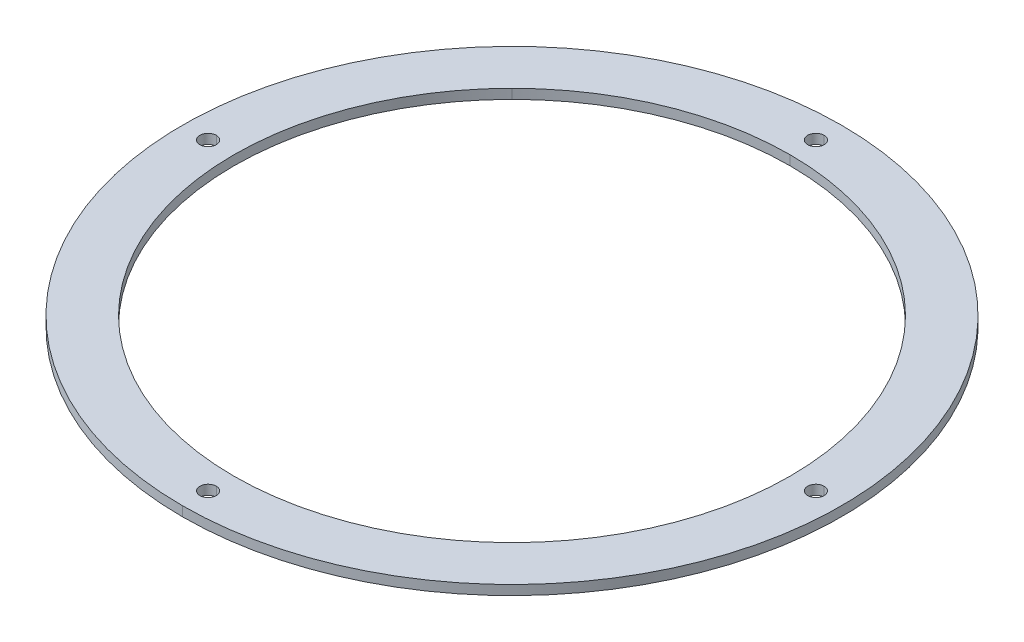
ISO-10303-21;
HEADER;
FILE_DESCRIPTION(('STEP AP214'),'2;1');
FILE_NAME('part.step','',(''),(''),'','','');
FILE_SCHEMA(('AUTOMOTIVE_DESIGN { 1 0 10303 214 1 1 1 1 }'));
ENDSEC;
DATA;
#1=APPLICATION_CONTEXT('core data for automotive mechanical design processes');
#2=APPLICATION_PROTOCOL_DEFINITION('international standard','automotive_design',2000,#1);
#3=PRODUCT_CONTEXT('',#1,'mechanical');
#4=PRODUCT('Part','Part','',(#3));
#5=PRODUCT_RELATED_PRODUCT_CATEGORY('part','',(#4));
#6=PRODUCT_DEFINITION_FORMATION('','',#4);
#7=PRODUCT_DEFINITION_CONTEXT('part definition',#1,'design');
#8=PRODUCT_DEFINITION('design','',#6,#7);
#9=PRODUCT_DEFINITION_SHAPE('','',#8);
#10=(LENGTH_UNIT() NAMED_UNIT(*) SI_UNIT(.MILLI.,.METRE.));
#11=(NAMED_UNIT(*) PLANE_ANGLE_UNIT() SI_UNIT($,.RADIAN.));
#12=(NAMED_UNIT(*) SI_UNIT($,.STERADIAN.) SOLID_ANGLE_UNIT());
#13=UNCERTAINTY_MEASURE_WITH_UNIT(LENGTH_MEASURE(1.E-05),#10,'distance_accuracy_value','');
#14=(GEOMETRIC_REPRESENTATION_CONTEXT(3) GLOBAL_UNCERTAINTY_ASSIGNED_CONTEXT((#13)) GLOBAL_UNIT_ASSIGNED_CONTEXT((#10,
#11,#12)) REPRESENTATION_CONTEXT('',''));
#15=CARTESIAN_POINT('',(0.,0.,0.));
#16=DIRECTION('',(0.,0.,1.));
#17=DIRECTION('',(1.,0.,0.));
#18=AXIS2_PLACEMENT_3D('',#15,#16,#17);
#19=CARTESIAN_POINT('',(0.,0.,0.));
#20=DIRECTION('',(0.,1.,0.));
#21=DIRECTION('',(1.,0.,0.));
#22=AXIS2_PLACEMENT_3D('',#19,#20,#21);
#23=PLANE('',#22);
#24=CARTESIAN_POINT('',(0.,0.,-94.75));
#25=DIRECTION('',(0.,1.,0.));
#26=DIRECTION('',(0.,0.,1.));
#27=AXIS2_PLACEMENT_3D('',#24,#25,#26);
#28=CIRCLE('',#27,2.5527);
#29=CARTESIAN_POINT('',(0.,0.,-97.3027));
#30=VERTEX_POINT('',#29);
#31=CARTESIAN_POINT('',(0.,0.,-92.1973));
#32=VERTEX_POINT('',#31);
#33=EDGE_CURVE('E165',#30,#32,#28,.T.);
#34=ORIENTED_EDGE('',*,*,#33,.T.);
#35=CARTESIAN_POINT('',(0.,0.,-94.75));
#36=DIRECTION('',(0.,1.,0.));
#37=DIRECTION('',(0.,0.,1.));
#38=AXIS2_PLACEMENT_3D('',#35,#36,#37);
#39=CIRCLE('',#38,2.5527);
#40=EDGE_CURVE('E11',#32,#30,#39,.T.);
#41=ORIENTED_EDGE('',*,*,#40,.T.);
#42=EDGE_LOOP('',(#34,#41));
#43=FACE_BOUND('',#42,.T.);
#44=CARTESIAN_POINT('',(-0.001,0.,-0.001));
#45=DIRECTION('',(0.,1.,0.));
#46=DIRECTION('',(0.,0.,1.));
#47=AXIS2_PLACEMENT_3D('',#44,#45,#46);
#48=CIRCLE('',#47,86.75);
#49=CARTESIAN_POINT('',(-61.3420132658952,0.,-61.3430132658953));
#50=VERTEX_POINT('',#49);
#51=CARTESIAN_POINT('',(-61.3420132658953,0.,61.3410132658952));
#52=VERTEX_POINT('',#51);
#53=EDGE_CURVE('E279',#50,#52,#48,.T.);
#54=ORIENTED_EDGE('',*,*,#53,.T.);
#55=CARTESIAN_POINT('',(0.,0.,0.));
#56=DIRECTION('',(0.,1.,0.));
#57=DIRECTION('',(0.,0.,1.));
#58=AXIS2_PLACEMENT_3D('',#55,#56,#57);
#59=CIRCLE('',#58,86.75);
#60=CARTESIAN_POINT('',(61.3420132658951,0.,61.3410132658953));
#61=VERTEX_POINT('',#60);
#62=EDGE_CURVE('E51',#52,#61,#59,.T.);
#63=ORIENTED_EDGE('',*,*,#62,.T.);
#64=CARTESIAN_POINT('',(0.001,0.,-0.001));
#65=DIRECTION('',(0.,1.,0.));
#66=DIRECTION('',(0.,0.,1.));
#67=AXIS2_PLACEMENT_3D('',#64,#65,#66);
#68=CIRCLE('',#67,86.75);
#69=CARTESIAN_POINT('',(61.3420132658953,0.,-61.3430132658951));
#70=VERTEX_POINT('',#69);
#71=EDGE_CURVE('E298',#61,#70,#68,.T.);
#72=ORIENTED_EDGE('',*,*,#71,.T.);
#73=CARTESIAN_POINT('',(0.,0.,-0.002));
#74=DIRECTION('',(0.,1.,0.));
#75=DIRECTION('',(0.,0.,1.));
#76=AXIS2_PLACEMENT_3D('',#73,#74,#75);
#77=CIRCLE('',#76,86.75);
#78=CARTESIAN_POINT('',(0.,0.,-86.752));
#79=VERTEX_POINT('',#78);
#80=EDGE_CURVE('E215',#70,#79,#77,.T.);
#81=ORIENTED_EDGE('',*,*,#80,.T.);
#82=CARTESIAN_POINT('',(0.,0.,-0.002));
#83=DIRECTION('',(0.,1.,0.));
#84=DIRECTION('',(0.,0.,1.));
#85=AXIS2_PLACEMENT_3D('',#82,#83,#84);
#86=CIRCLE('',#85,86.75);
#87=EDGE_CURVE('E295',#79,#50,#86,.T.);
#88=ORIENTED_EDGE('',*,*,#87,.T.);
#89=EDGE_LOOP('',(#54,#63,#72,#81,#88));
#90=FACE_BOUND('',#89,.T.);
#91=CARTESIAN_POINT('',(94.75,0.,0.));
#92=DIRECTION('',(0.,1.,0.));
#93=DIRECTION('',(0.,0.,1.));
#94=AXIS2_PLACEMENT_3D('',#91,#92,#93);
#95=CIRCLE('',#94,2.5527);
#96=CARTESIAN_POINT('',(94.75,0.,-2.5527));
#97=VERTEX_POINT('',#96);
#98=CARTESIAN_POINT('',(94.75,0.,2.5527));
#99=VERTEX_POINT('',#98);
#100=EDGE_CURVE('E251',#97,#99,#95,.T.);
#101=ORIENTED_EDGE('',*,*,#100,.T.);
#102=CARTESIAN_POINT('',(94.75,0.,0.));
#103=DIRECTION('',(0.,1.,0.));
#104=DIRECTION('',(0.,0.,1.));
#105=AXIS2_PLACEMENT_3D('',#102,#103,#104);
#106=CIRCLE('',#105,2.5527);
#107=EDGE_CURVE('E311',#99,#97,#106,.T.);
#108=ORIENTED_EDGE('',*,*,#107,.T.);
#109=EDGE_LOOP('',(#101,#108));
#110=FACE_BOUND('',#109,.T.);
#111=CARTESIAN_POINT('',(0.,0.,94.75));
#112=DIRECTION('',(0.,1.,0.));
#113=DIRECTION('',(0.,0.,1.));
#114=AXIS2_PLACEMENT_3D('',#111,#112,#113);
#115=CIRCLE('',#114,2.5527);
#116=CARTESIAN_POINT('',(0.,0.,92.1973));
#117=VERTEX_POINT('',#116);
#118=CARTESIAN_POINT('',(0.,0.,97.3027));
#119=VERTEX_POINT('',#118);
#120=EDGE_CURVE('E235',#117,#119,#115,.T.);
#121=ORIENTED_EDGE('',*,*,#120,.T.);
#122=CARTESIAN_POINT('',(0.,0.,94.75));
#123=DIRECTION('',(0.,1.,0.));
#124=DIRECTION('',(0.,0.,1.));
#125=AXIS2_PLACEMENT_3D('',#122,#123,#124);
#126=CIRCLE('',#125,2.5527);
#127=EDGE_CURVE('E289',#119,#117,#126,.T.);
#128=ORIENTED_EDGE('',*,*,#127,.T.);
#129=EDGE_LOOP('',(#121,#128));
#130=FACE_BOUND('',#129,.T.);
#131=CARTESIAN_POINT('',(-94.75,0.,0.));
#132=DIRECTION('',(0.,1.,0.));
#133=DIRECTION('',(0.,0.,1.));
#134=AXIS2_PLACEMENT_3D('',#131,#132,#133);
#135=CIRCLE('',#134,2.5527);
#136=CARTESIAN_POINT('',(-94.75,0.,-2.55270000000004));
#137=VERTEX_POINT('',#136);
#138=CARTESIAN_POINT('',(-94.75,0.,2.5527));
#139=VERTEX_POINT('',#138);
#140=EDGE_CURVE('E225',#137,#139,#135,.T.);
#141=ORIENTED_EDGE('',*,*,#140,.T.);
#142=CARTESIAN_POINT('',(-94.75,0.,0.));
#143=DIRECTION('',(0.,1.,0.));
#144=DIRECTION('',(0.,0.,1.));
#145=AXIS2_PLACEMENT_3D('',#142,#143,#144);
#146=CIRCLE('',#145,2.5527);
#147=EDGE_CURVE('E265',#139,#137,#146,.T.);
#148=ORIENTED_EDGE('',*,*,#147,.T.);
#149=EDGE_LOOP('',(#141,#148));
#150=FACE_BOUND('',#149,.T.);
#151=CARTESIAN_POINT('',(0.,0.,0.));
#152=DIRECTION('',(0.,1.,0.));
#153=DIRECTION('',(0.,0.,1.));
#154=AXIS2_PLACEMENT_3D('',#151,#152,#153);
#155=CIRCLE('',#154,102.75);
#156=CARTESIAN_POINT('',(0.,0.,-102.75));
#157=VERTEX_POINT('',#156);
#158=CARTESIAN_POINT('',(0.,0.,102.75));
#159=VERTEX_POINT('',#158);
#160=EDGE_CURVE('E20',#157,#159,#155,.T.);
#161=ORIENTED_EDGE('',*,*,#160,.F.);
#162=CARTESIAN_POINT('',(0.,0.,0.));
#163=DIRECTION('',(0.,1.,0.));
#164=DIRECTION('',(0.,0.,1.));
#165=AXIS2_PLACEMENT_3D('',#162,#163,#164);
#166=CIRCLE('',#165,102.75);
#167=EDGE_CURVE('E190',#159,#157,#166,.T.);
#168=ORIENTED_EDGE('',*,*,#167,.F.);
#169=EDGE_LOOP('',(#161,#168));
#170=FACE_BOUND('',#169,.T.);
#171=ADVANCED_FACE('F17',(#43,#90,#110,#130,#150,#170),#23,.F.);
#172=CARTESIAN_POINT('',(0.,2.9972,0.));
#173=DIRECTION('',(0.,1.,0.));
#174=DIRECTION('',(1.,0.,0.));
#175=AXIS2_PLACEMENT_3D('',#172,#173,#174);
#176=PLANE('',#175);
#177=CARTESIAN_POINT('',(0.,2.9972,-94.75));
#178=DIRECTION('',(0.,1.,0.));
#179=DIRECTION('',(0.,0.,1.));
#180=AXIS2_PLACEMENT_3D('',#177,#178,#179);
#181=CIRCLE('',#180,2.5527);
#182=CARTESIAN_POINT('',(0.,2.9972,-97.3027));
#183=VERTEX_POINT('',#182);
#184=CARTESIAN_POINT('',(0.,2.9972,-92.1973));
#185=VERTEX_POINT('',#184);
#186=EDGE_CURVE('E186',#183,#185,#181,.T.);
#187=ORIENTED_EDGE('',*,*,#186,.F.);
#188=CARTESIAN_POINT('',(0.,2.9972,-94.75));
#189=DIRECTION('',(0.,1.,0.));
#190=DIRECTION('',(0.,0.,1.));
#191=AXIS2_PLACEMENT_3D('',#188,#189,#190);
#192=CIRCLE('',#191,2.5527);
#193=EDGE_CURVE('E26',#185,#183,#192,.T.);
#194=ORIENTED_EDGE('',*,*,#193,.F.);
#195=EDGE_LOOP('',(#187,#194));
#196=FACE_BOUND('',#195,.T.);
#197=CARTESIAN_POINT('',(-0.001,2.9972,-0.001));
#198=DIRECTION('',(0.,1.,0.));
#199=DIRECTION('',(0.,0.,1.));
#200=AXIS2_PLACEMENT_3D('',#197,#198,#199);
#201=CIRCLE('',#200,86.75);
#202=CARTESIAN_POINT('',(-61.3420132658952,2.9972,-61.3430132658953));
#203=VERTEX_POINT('',#202);
#204=CARTESIAN_POINT('',(-61.3420132658953,2.9972,61.3410132658952));
#205=VERTEX_POINT('',#204);
#206=EDGE_CURVE('E257',#203,#205,#201,.T.);
#207=ORIENTED_EDGE('',*,*,#206,.F.);
#208=CARTESIAN_POINT('',(0.,2.9972,-0.002));
#209=DIRECTION('',(0.,1.,0.));
#210=DIRECTION('',(0.,0.,1.));
#211=AXIS2_PLACEMENT_3D('',#208,#209,#210);
#212=CIRCLE('',#211,86.75);
#213=CARTESIAN_POINT('',(0.,2.9972,-86.752));
#214=VERTEX_POINT('',#213);
#215=EDGE_CURVE('E256',#214,#203,#212,.T.);
#216=ORIENTED_EDGE('',*,*,#215,.F.);
#217=CARTESIAN_POINT('',(0.,2.9972,-0.002));
#218=DIRECTION('',(0.,1.,0.));
#219=DIRECTION('',(0.,0.,1.));
#220=AXIS2_PLACEMENT_3D('',#217,#218,#219);
#221=CIRCLE('',#220,86.75);
#222=CARTESIAN_POINT('',(61.3420132658953,2.9972,-61.3430132658951));
#223=VERTEX_POINT('',#222);
#224=EDGE_CURVE('E216',#223,#214,#221,.T.);
#225=ORIENTED_EDGE('',*,*,#224,.F.);
#226=CARTESIAN_POINT('',(0.001,2.9972,-0.001));
#227=DIRECTION('',(0.,1.,0.));
#228=DIRECTION('',(0.,0.,1.));
#229=AXIS2_PLACEMENT_3D('',#226,#227,#228);
#230=CIRCLE('',#229,86.75);
#231=CARTESIAN_POINT('',(61.3420132658951,2.9972,61.3410132658953));
#232=VERTEX_POINT('',#231);
#233=EDGE_CURVE('E201',#232,#223,#230,.T.);
#234=ORIENTED_EDGE('',*,*,#233,.F.);
#235=CARTESIAN_POINT('',(0.,2.9972,0.));
#236=DIRECTION('',(0.,1.,0.));
#237=DIRECTION('',(0.,0.,1.));
#238=AXIS2_PLACEMENT_3D('',#235,#236,#237);
#239=CIRCLE('',#238,86.75);
#240=EDGE_CURVE('E40',#205,#232,#239,.T.);
#241=ORIENTED_EDGE('',*,*,#240,.F.);
#242=EDGE_LOOP('',(#207,#216,#225,#234,#241));
#243=FACE_BOUND('',#242,.T.);
#244=CARTESIAN_POINT('',(94.75,2.9972,0.));
#245=DIRECTION('',(0.,1.,0.));
#246=DIRECTION('',(0.,0.,1.));
#247=AXIS2_PLACEMENT_3D('',#244,#245,#246);
#248=CIRCLE('',#247,2.5527);
#249=CARTESIAN_POINT('',(94.75,2.9972,-2.5527));
#250=VERTEX_POINT('',#249);
#251=CARTESIAN_POINT('',(94.75,2.9972,2.5527));
#252=VERTEX_POINT('',#251);
#253=EDGE_CURVE('E243',#250,#252,#248,.T.);
#254=ORIENTED_EDGE('',*,*,#253,.F.);
#255=CARTESIAN_POINT('',(94.75,2.9972,0.));
#256=DIRECTION('',(0.,1.,0.));
#257=DIRECTION('',(0.,0.,1.));
#258=AXIS2_PLACEMENT_3D('',#255,#256,#257);
#259=CIRCLE('',#258,2.5527);
#260=EDGE_CURVE('E308',#252,#250,#259,.T.);
#261=ORIENTED_EDGE('',*,*,#260,.F.);
#262=EDGE_LOOP('',(#254,#261));
#263=FACE_BOUND('',#262,.T.);
#264=CARTESIAN_POINT('',(0.,2.9972,94.75));
#265=DIRECTION('',(0.,1.,0.));
#266=DIRECTION('',(0.,0.,1.));
#267=AXIS2_PLACEMENT_3D('',#264,#265,#266);
#268=CIRCLE('',#267,2.5527);
#269=CARTESIAN_POINT('',(0.,2.9972,92.1973));
#270=VERTEX_POINT('',#269);
#271=CARTESIAN_POINT('',(0.,2.9972,97.3027));
#272=VERTEX_POINT('',#271);
#273=EDGE_CURVE('E205',#270,#272,#268,.T.);
#274=ORIENTED_EDGE('',*,*,#273,.F.);
#275=CARTESIAN_POINT('',(0.,2.9972,94.75));
#276=DIRECTION('',(0.,1.,0.));
#277=DIRECTION('',(0.,0.,1.));
#278=AXIS2_PLACEMENT_3D('',#275,#276,#277);
#279=CIRCLE('',#278,2.5527);
#280=EDGE_CURVE('E314',#272,#270,#279,.T.);
#281=ORIENTED_EDGE('',*,*,#280,.F.);
#282=EDGE_LOOP('',(#274,#281));
#283=FACE_BOUND('',#282,.T.);
#284=CARTESIAN_POINT('',(-94.75,2.9972,0.));
#285=DIRECTION('',(0.,1.,0.));
#286=DIRECTION('',(0.,0.,1.));
#287=AXIS2_PLACEMENT_3D('',#284,#285,#286);
#288=CIRCLE('',#287,2.5527);
#289=CARTESIAN_POINT('',(-94.75,2.9972,-2.55270000000004));
#290=VERTEX_POINT('',#289);
#291=CARTESIAN_POINT('',(-94.75,2.9972,2.5527));
#292=VERTEX_POINT('',#291);
#293=EDGE_CURVE('E220',#290,#292,#288,.T.);
#294=ORIENTED_EDGE('',*,*,#293,.F.);
#295=CARTESIAN_POINT('',(-94.75,2.9972,0.));
#296=DIRECTION('',(0.,1.,0.));
#297=DIRECTION('',(0.,0.,1.));
#298=AXIS2_PLACEMENT_3D('',#295,#296,#297);
#299=CIRCLE('',#298,2.5527);
#300=EDGE_CURVE('E286',#292,#290,#299,.T.);
#301=ORIENTED_EDGE('',*,*,#300,.F.);
#302=EDGE_LOOP('',(#294,#301));
#303=FACE_BOUND('',#302,.T.);
#304=CARTESIAN_POINT('',(0.,2.9972,0.));
#305=DIRECTION('',(0.,1.,0.));
#306=DIRECTION('',(0.,0.,1.));
#307=AXIS2_PLACEMENT_3D('',#304,#305,#306);
#308=CIRCLE('',#307,102.75);
#309=CARTESIAN_POINT('',(0.,2.9972,-102.75));
#310=VERTEX_POINT('',#309);
#311=CARTESIAN_POINT('',(0.,2.9972,102.75));
#312=VERTEX_POINT('',#311);
#313=EDGE_CURVE('E262',#310,#312,#308,.T.);
#314=ORIENTED_EDGE('',*,*,#313,.T.);
#315=CARTESIAN_POINT('',(0.,2.9972,0.));
#316=DIRECTION('',(0.,1.,0.));
#317=DIRECTION('',(0.,0.,1.));
#318=AXIS2_PLACEMENT_3D('',#315,#316,#317);
#319=CIRCLE('',#318,102.75);
#320=EDGE_CURVE('E176',#312,#310,#319,.T.);
#321=ORIENTED_EDGE('',*,*,#320,.T.);
#322=EDGE_LOOP('',(#314,#321));
#323=FACE_BOUND('',#322,.T.);
#324=ADVANCED_FACE('F336',(#196,#243,#263,#283,#303,#323),#176,.T.);
#325=CARTESIAN_POINT('',(0.,2.9972,-94.75));
#326=DIRECTION('',(0.,-1.,0.));
#327=DIRECTION('',(0.,0.,-1.));
#328=AXIS2_PLACEMENT_3D('',#325,#326,#327);
#329=CYLINDRICAL_SURFACE('',#328,2.5527);
#330=DIRECTION('',(0.,-1.,0.));
#331=VECTOR('',#330,1.);
#332=CARTESIAN_POINT('',(0.,2.9972,-92.1973));
#333=LINE('',#332,#331);
#334=EDGE_CURVE('E179',#185,#32,#333,.T.);
#335=ORIENTED_EDGE('',*,*,#334,.F.);
#336=ORIENTED_EDGE('',*,*,#193,.T.);
#337=DIRECTION('',(0.,-1.,0.));
#338=VECTOR('',#337,1.);
#339=CARTESIAN_POINT('',(0.,2.9972,-97.3027));
#340=LINE('',#339,#338);
#341=EDGE_CURVE('E170',#183,#30,#340,.T.);
#342=ORIENTED_EDGE('',*,*,#341,.T.);
#343=ORIENTED_EDGE('',*,*,#40,.F.);
#344=EDGE_LOOP('',(#335,#336,#342,#343));
#345=FACE_BOUND('',#344,.T.);
#346=ADVANCED_FACE('F171',(#345),#329,.F.);
#347=CARTESIAN_POINT('',(0.,2.9972,0.));
#348=DIRECTION('',(0.,-1.,0.));
#349=DIRECTION('',(0.,0.,-1.));
#350=AXIS2_PLACEMENT_3D('',#347,#348,#349);
#351=CYLINDRICAL_SURFACE('',#350,102.75);
#352=DIRECTION('',(0.,-1.,0.));
#353=VECTOR('',#352,1.);
#354=CARTESIAN_POINT('',(0.,2.9972,102.75));
#355=LINE('',#354,#353);
#356=EDGE_CURVE('E194',#312,#159,#355,.T.);
#357=ORIENTED_EDGE('',*,*,#356,.F.);
#358=ORIENTED_EDGE('',*,*,#313,.F.);
#359=DIRECTION('',(0.,-1.,0.));
#360=VECTOR('',#359,1.);
#361=CARTESIAN_POINT('',(0.,2.9972,-102.75));
#362=LINE('',#361,#360);
#363=EDGE_CURVE('E193',#310,#157,#362,.T.);
#364=ORIENTED_EDGE('',*,*,#363,.T.);
#365=ORIENTED_EDGE('',*,*,#160,.T.);
#366=EDGE_LOOP('',(#357,#358,#364,#365));
#367=FACE_BOUND('',#366,.T.);
#368=ADVANCED_FACE('F329',(#367),#351,.T.);
#369=CARTESIAN_POINT('',(-94.75,2.9972,0.));
#370=DIRECTION('',(0.,-1.,0.));
#371=DIRECTION('',(0.,0.,-1.));
#372=AXIS2_PLACEMENT_3D('',#369,#370,#371);
#373=CYLINDRICAL_SURFACE('',#372,2.5527);
#374=DIRECTION('',(0.,-1.,0.));
#375=VECTOR('',#374,1.);
#376=CARTESIAN_POINT('',(-94.75,2.9972,2.5527));
#377=LINE('',#376,#375);
#378=EDGE_CURVE('E224',#292,#139,#377,.T.);
#379=ORIENTED_EDGE('',*,*,#378,.F.);
#380=ORIENTED_EDGE('',*,*,#300,.T.);
#381=DIRECTION('',(0.,-1.,0.));
#382=VECTOR('',#381,1.);
#383=CARTESIAN_POINT('',(-94.75,2.9972,-2.55270000000004));
#384=LINE('',#383,#382);
#385=EDGE_CURVE('E210',#290,#137,#384,.T.);
#386=ORIENTED_EDGE('',*,*,#385,.T.);
#387=ORIENTED_EDGE('',*,*,#147,.F.);
#388=EDGE_LOOP('',(#379,#380,#386,#387));
#389=FACE_BOUND('',#388,.T.);
#390=ADVANCED_FACE('F353',(#389),#373,.F.);
#391=CARTESIAN_POINT('',(0.,2.9972,94.75));
#392=DIRECTION('',(0.,-1.,0.));
#393=DIRECTION('',(0.,0.,-1.));
#394=AXIS2_PLACEMENT_3D('',#391,#392,#393);
#395=CYLINDRICAL_SURFACE('',#394,2.5527);
#396=DIRECTION('',(0.,-1.,0.));
#397=VECTOR('',#396,1.);
#398=CARTESIAN_POINT('',(0.,2.9972,97.3027));
#399=LINE('',#398,#397);
#400=EDGE_CURVE('E209',#272,#119,#399,.T.);
#401=ORIENTED_EDGE('',*,*,#400,.F.);
#402=ORIENTED_EDGE('',*,*,#280,.T.);
#403=DIRECTION('',(0.,-1.,0.));
#404=VECTOR('',#403,1.);
#405=CARTESIAN_POINT('',(0.,2.9972,92.1973));
#406=LINE('',#405,#404);
#407=EDGE_CURVE('E239',#270,#117,#406,.T.);
#408=ORIENTED_EDGE('',*,*,#407,.T.);
#409=ORIENTED_EDGE('',*,*,#127,.F.);
#410=EDGE_LOOP('',(#401,#402,#408,#409));
#411=FACE_BOUND('',#410,.T.);
#412=ADVANCED_FACE('F356',(#411),#395,.F.);
#413=CARTESIAN_POINT('',(94.75,2.9972,0.));
#414=DIRECTION('',(0.,-1.,0.));
#415=DIRECTION('',(0.,0.,-1.));
#416=AXIS2_PLACEMENT_3D('',#413,#414,#415);
#417=CYLINDRICAL_SURFACE('',#416,2.5527);
#418=DIRECTION('',(0.,-1.,0.));
#419=VECTOR('',#418,1.);
#420=CARTESIAN_POINT('',(94.75,2.9972,2.5527));
#421=LINE('',#420,#419);
#422=EDGE_CURVE('E247',#252,#99,#421,.T.);
#423=ORIENTED_EDGE('',*,*,#422,.F.);
#424=ORIENTED_EDGE('',*,*,#260,.T.);
#425=DIRECTION('',(0.,-1.,0.));
#426=VECTOR('',#425,1.);
#427=CARTESIAN_POINT('',(94.75,2.9972,-2.5527));
#428=LINE('',#427,#426);
#429=EDGE_CURVE('E261',#250,#97,#428,.T.);
#430=ORIENTED_EDGE('',*,*,#429,.T.);
#431=ORIENTED_EDGE('',*,*,#107,.F.);
#432=EDGE_LOOP('',(#423,#424,#430,#431));
#433=FACE_BOUND('',#432,.T.);
#434=ADVANCED_FACE('F390',(#433),#417,.F.);
#435=CARTESIAN_POINT('',(0.,2.9972,0.));
#436=DIRECTION('',(0.,-1.,0.));
#437=DIRECTION('',(0.,0.,-1.));
#438=AXIS2_PLACEMENT_3D('',#435,#436,#437);
#439=CYLINDRICAL_SURFACE('',#438,86.75);
#440=ORIENTED_EDGE('',*,*,#62,.F.);
#441=DIRECTION('',(0.,-1.,0.));
#442=VECTOR('',#441,1.);
#443=CARTESIAN_POINT('',(-61.3420132658953,2.9972,61.3410132658952));
#444=LINE('',#443,#442);
#445=EDGE_CURVE('E252',#205,#52,#444,.T.);
#446=ORIENTED_EDGE('',*,*,#445,.F.);
#447=ORIENTED_EDGE('',*,*,#240,.T.);
#448=DIRECTION('',(0.,-1.,0.));
#449=VECTOR('',#448,1.);
#450=CARTESIAN_POINT('',(61.3420132658951,2.9972,61.3410132658953));
#451=LINE('',#450,#449);
#452=EDGE_CURVE('E301',#232,#61,#451,.T.);
#453=ORIENTED_EDGE('',*,*,#452,.T.);
#454=EDGE_LOOP('',(#440,#446,#447,#453));
#455=FACE_BOUND('',#454,.T.);
#456=ADVANCED_FACE('F377',(#455),#439,.F.);
#457=CARTESIAN_POINT('',(0.001,2.9972,-0.001));
#458=DIRECTION('',(0.,-1.,0.));
#459=DIRECTION('',(0.,0.,-1.));
#460=AXIS2_PLACEMENT_3D('',#457,#458,#459);
#461=CYLINDRICAL_SURFACE('',#460,86.75);
#462=ORIENTED_EDGE('',*,*,#71,.F.);
#463=ORIENTED_EDGE('',*,*,#452,.F.);
#464=ORIENTED_EDGE('',*,*,#233,.T.);
#465=DIRECTION('',(0.,-1.,0.));
#466=VECTOR('',#465,1.);
#467=CARTESIAN_POINT('',(61.3420132658953,2.9972,-61.3430132658951));
#468=LINE('',#467,#466);
#469=EDGE_CURVE('E275',#223,#70,#468,.T.);
#470=ORIENTED_EDGE('',*,*,#469,.T.);
#471=EDGE_LOOP('',(#462,#463,#464,#470));
#472=FACE_BOUND('',#471,.T.);
#473=ADVANCED_FACE('F374',(#472),#461,.F.);
#474=CARTESIAN_POINT('',(0.,2.9972,-0.002));
#475=DIRECTION('',(0.,-1.,0.));
#476=DIRECTION('',(0.,0.,-1.));
#477=AXIS2_PLACEMENT_3D('',#474,#475,#476);
#478=CYLINDRICAL_SURFACE('',#477,86.75);
#479=DIRECTION('',(0.,-1.,0.));
#480=VECTOR('',#479,1.);
#481=CARTESIAN_POINT('',(0.,2.9972,-86.752));
#482=LINE('',#481,#480);
#483=EDGE_CURVE('E211',#214,#79,#482,.T.);
#484=ORIENTED_EDGE('',*,*,#483,.F.);
#485=ORIENTED_EDGE('',*,*,#215,.T.);
#486=DIRECTION('',(0.,-1.,0.));
#487=VECTOR('',#486,1.);
#488=CARTESIAN_POINT('',(-61.3420132658952,2.9972,-61.3430132658953));
#489=LINE('',#488,#487);
#490=EDGE_CURVE('E282',#203,#50,#489,.T.);
#491=ORIENTED_EDGE('',*,*,#490,.T.);
#492=ORIENTED_EDGE('',*,*,#87,.F.);
#493=EDGE_LOOP('',(#484,#485,#491,#492));
#494=FACE_BOUND('',#493,.T.);
#495=ADVANCED_FACE('F362',(#494),#478,.F.);
#496=CARTESIAN_POINT('',(-0.001,2.9972,-0.001));
#497=DIRECTION('',(0.,-1.,0.));
#498=DIRECTION('',(0.,0.,-1.));
#499=AXIS2_PLACEMENT_3D('',#496,#497,#498);
#500=CYLINDRICAL_SURFACE('',#499,86.75);
#501=ORIENTED_EDGE('',*,*,#53,.F.);
#502=ORIENTED_EDGE('',*,*,#490,.F.);
#503=ORIENTED_EDGE('',*,*,#206,.T.);
#504=ORIENTED_EDGE('',*,*,#445,.T.);
#505=EDGE_LOOP('',(#501,#502,#503,#504));
#506=FACE_BOUND('',#505,.T.);
#507=ADVANCED_FACE('F358',(#506),#500,.F.);
#508=CARTESIAN_POINT('',(0.,2.9972,-0.002));
#509=DIRECTION('',(0.,-1.,0.));
#510=DIRECTION('',(0.,0.,-1.));
#511=AXIS2_PLACEMENT_3D('',#508,#509,#510);
#512=CYLINDRICAL_SURFACE('',#511,86.75);
#513=ORIENTED_EDGE('',*,*,#224,.T.);
#514=ORIENTED_EDGE('',*,*,#483,.T.);
#515=ORIENTED_EDGE('',*,*,#80,.F.);
#516=ORIENTED_EDGE('',*,*,#469,.F.);
#517=EDGE_LOOP('',(#513,#514,#515,#516));
#518=FACE_BOUND('',#517,.T.);
#519=ADVANCED_FACE('F361',(#518),#512,.F.);
#520=CARTESIAN_POINT('',(94.75,2.9972,0.));
#521=DIRECTION('',(0.,-1.,0.));
#522=DIRECTION('',(0.,0.,-1.));
#523=AXIS2_PLACEMENT_3D('',#520,#521,#522);
#524=CYLINDRICAL_SURFACE('',#523,2.5527);
#525=ORIENTED_EDGE('',*,*,#253,.T.);
#526=ORIENTED_EDGE('',*,*,#422,.T.);
#527=ORIENTED_EDGE('',*,*,#100,.F.);
#528=ORIENTED_EDGE('',*,*,#429,.F.);
#529=EDGE_LOOP('',(#525,#526,#527,#528));
#530=FACE_BOUND('',#529,.T.);
#531=ADVANCED_FACE('F370',(#530),#524,.F.);
#532=CARTESIAN_POINT('',(0.,2.9972,94.75));
#533=DIRECTION('',(0.,-1.,0.));
#534=DIRECTION('',(0.,0.,-1.));
#535=AXIS2_PLACEMENT_3D('',#532,#533,#534);
#536=CYLINDRICAL_SURFACE('',#535,2.5527);
#537=ORIENTED_EDGE('',*,*,#273,.T.);
#538=ORIENTED_EDGE('',*,*,#400,.T.);
#539=ORIENTED_EDGE('',*,*,#120,.F.);
#540=ORIENTED_EDGE('',*,*,#407,.F.);
#541=EDGE_LOOP('',(#537,#538,#539,#540));
#542=FACE_BOUND('',#541,.T.);
#543=ADVANCED_FACE('F366',(#542),#536,.F.);
#544=CARTESIAN_POINT('',(-94.75,2.9972,0.));
#545=DIRECTION('',(0.,-1.,0.));
#546=DIRECTION('',(0.,0.,-1.));
#547=AXIS2_PLACEMENT_3D('',#544,#545,#546);
#548=CYLINDRICAL_SURFACE('',#547,2.5527);
#549=ORIENTED_EDGE('',*,*,#293,.T.);
#550=ORIENTED_EDGE('',*,*,#378,.T.);
#551=ORIENTED_EDGE('',*,*,#140,.F.);
#552=ORIENTED_EDGE('',*,*,#385,.F.);
#553=EDGE_LOOP('',(#549,#550,#551,#552));
#554=FACE_BOUND('',#553,.T.);
#555=ADVANCED_FACE('F352',(#554),#548,.F.);
#556=CARTESIAN_POINT('',(0.,2.9972,0.));
#557=DIRECTION('',(0.,-1.,0.));
#558=DIRECTION('',(0.,0.,-1.));
#559=AXIS2_PLACEMENT_3D('',#556,#557,#558);
#560=CYLINDRICAL_SURFACE('',#559,102.75);
#561=ORIENTED_EDGE('',*,*,#320,.F.);
#562=ORIENTED_EDGE('',*,*,#356,.T.);
#563=ORIENTED_EDGE('',*,*,#167,.T.);
#564=ORIENTED_EDGE('',*,*,#363,.F.);
#565=EDGE_LOOP('',(#561,#562,#563,#564));
#566=FACE_BOUND('',#565,.T.);
#567=ADVANCED_FACE('F334',(#566),#560,.T.);
#568=CARTESIAN_POINT('',(0.,2.9972,-94.75));
#569=DIRECTION('',(0.,-1.,0.));
#570=DIRECTION('',(0.,0.,-1.));
#571=AXIS2_PLACEMENT_3D('',#568,#569,#570);
#572=CYLINDRICAL_SURFACE('',#571,2.5527);
#573=ORIENTED_EDGE('',*,*,#186,.T.);
#574=ORIENTED_EDGE('',*,*,#334,.T.);
#575=ORIENTED_EDGE('',*,*,#33,.F.);
#576=ORIENTED_EDGE('',*,*,#341,.F.);
#577=EDGE_LOOP('',(#573,#574,#575,#576));
#578=FACE_BOUND('',#577,.T.);
#579=ADVANCED_FACE('F178',(#578),#572,.F.);
#580=CLOSED_SHELL('',(#171,#324,#346,#368,#390,#412,#434,#456,#473,#495,#507,#519,#531,#543,
#555,#567,#579));
#581=MANIFOLD_SOLID_BREP('B1',#580);
#582=ADVANCED_BREP_SHAPE_REPRESENTATION('',(#18,#581),#14);
#583=SHAPE_DEFINITION_REPRESENTATION(#9,#582);
ENDSEC;
END-ISO-10303-21;
